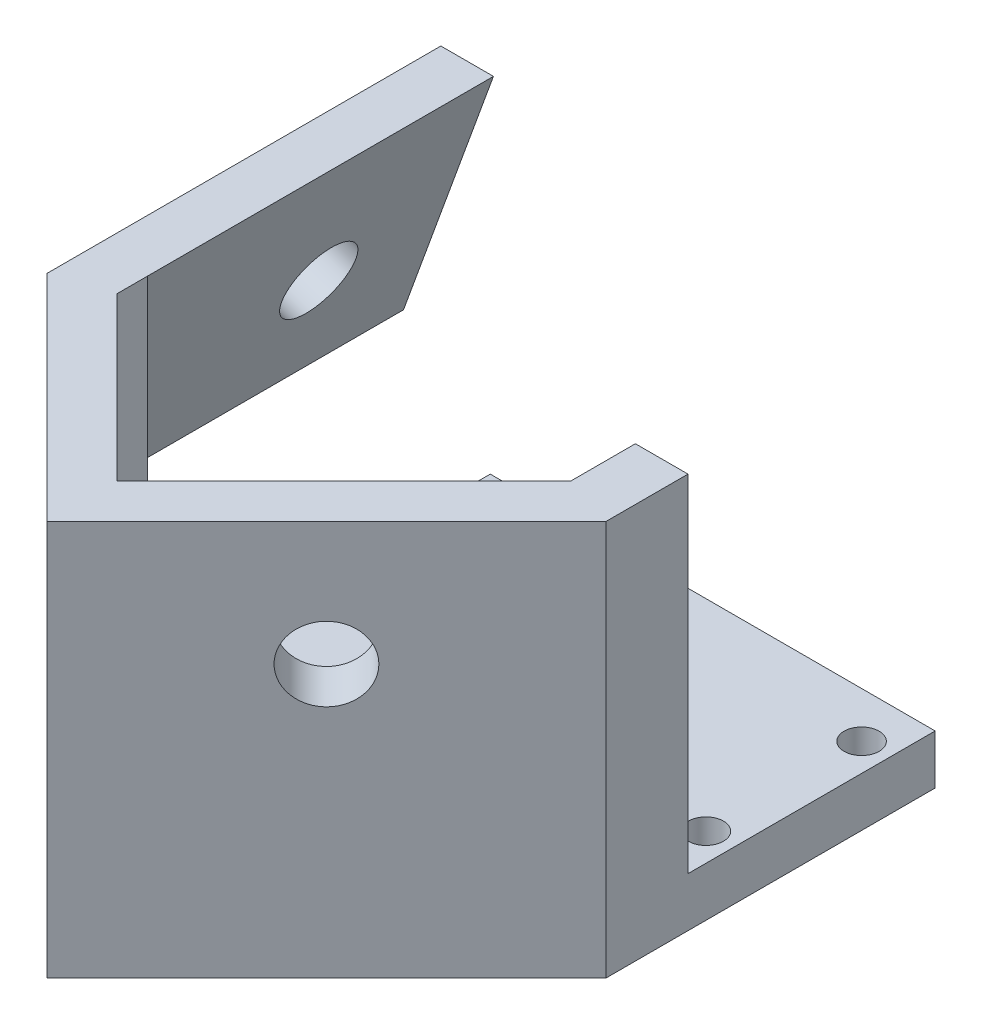
ISO-10303-21;
HEADER;
FILE_DESCRIPTION(('STEP AP214'),'2;1');
FILE_NAME('part.step','',(''),(''),'','','');
FILE_SCHEMA(('AUTOMOTIVE_DESIGN { 1 0 10303 214 1 1 1 1 }'));
ENDSEC;
DATA;
#1=APPLICATION_CONTEXT('core data for automotive mechanical design processes');
#2=APPLICATION_PROTOCOL_DEFINITION('international standard','automotive_design',2000,#1);
#3=PRODUCT_CONTEXT('',#1,'mechanical');
#4=PRODUCT('Part','Part','',(#3));
#5=PRODUCT_RELATED_PRODUCT_CATEGORY('part','',(#4));
#6=PRODUCT_DEFINITION_FORMATION('','',#4);
#7=PRODUCT_DEFINITION_CONTEXT('part definition',#1,'design');
#8=PRODUCT_DEFINITION('design','',#6,#7);
#9=PRODUCT_DEFINITION_SHAPE('','',#8);
#10=(LENGTH_UNIT() NAMED_UNIT(*) SI_UNIT(.MILLI.,.METRE.));
#11=(NAMED_UNIT(*) PLANE_ANGLE_UNIT() SI_UNIT($,.RADIAN.));
#12=(NAMED_UNIT(*) SI_UNIT($,.STERADIAN.) SOLID_ANGLE_UNIT());
#13=UNCERTAINTY_MEASURE_WITH_UNIT(LENGTH_MEASURE(1.E-05),#10,'distance_accuracy_value','');
#14=(GEOMETRIC_REPRESENTATION_CONTEXT(3) GLOBAL_UNCERTAINTY_ASSIGNED_CONTEXT((#13)) GLOBAL_UNIT_ASSIGNED_CONTEXT((#10,
#11,#12)) REPRESENTATION_CONTEXT('',''));
#15=CARTESIAN_POINT('',(0.,0.,0.));
#16=DIRECTION('',(0.,0.,1.));
#17=DIRECTION('',(1.,0.,0.));
#18=AXIS2_PLACEMENT_3D('',#15,#16,#17);
#19=CARTESIAN_POINT('',(-20.8214466605013,-91.040033250916,-10.5210244842766));
#20=DIRECTION('',(-1.,0.,0.));
#21=DIRECTION('',(0.,0.,1.));
#22=AXIS2_PLACEMENT_3D('',#19,#20,#21);
#23=PLANE('',#22);
#24=DIRECTION('',(0.,-1.,0.));
#25=VECTOR('',#24,1.);
#26=CARTESIAN_POINT('',(-20.8214466605013,15.875,2.17897551572339));
#27=LINE('',#26,#25);
#28=CARTESIAN_POINT('',(-20.8214466605013,15.875,2.17897551572339));
#29=VERTEX_POINT('',#28);
#30=CARTESIAN_POINT('',(-20.8214466605013,-28.575,2.17897551572339));
#31=VERTEX_POINT('',#30);
#32=EDGE_CURVE('E170',#29,#31,#27,.T.);
#33=ORIENTED_EDGE('',*,*,#32,.F.);
#34=DIRECTION('',(0.,0.,1.));
#35=VECTOR('',#34,1.);
#36=CARTESIAN_POINT('',(-20.8214466605013,15.875,-10.5210244842766));
#37=LINE('',#36,#35);
#38=CARTESIAN_POINT('',(-20.8214466605013,15.875,6.11932170270612));
#39=VERTEX_POINT('',#38);
#40=EDGE_CURVE('E175',#29,#39,#37,.T.);
#41=ORIENTED_EDGE('',*,*,#40,.T.);
#42=DIRECTION('',(0.,1.,0.));
#43=VECTOR('',#42,1.);
#44=CARTESIAN_POINT('',(-20.8214466605013,-91.040033250916,6.11932170270612));
#45=LINE('',#44,#43);
#46=CARTESIAN_POINT('',(-20.8214466605013,-28.575,6.11932170270612));
#47=VERTEX_POINT('',#46);
#48=EDGE_CURVE('E192',#47,#39,#45,.T.);
#49=ORIENTED_EDGE('',*,*,#48,.F.);
#50=DIRECTION('',(0.,0.,-1.));
#51=VECTOR('',#50,1.);
#52=CARTESIAN_POINT('',(-20.8214466605013,-28.575,-10.5210244842766));
#53=LINE('',#52,#51);
#54=EDGE_CURVE('E182',#47,#31,#53,.T.);
#55=ORIENTED_EDGE('',*,*,#54,.T.);
#56=EDGE_LOOP('',(#33,#41,#49,#55));
#57=FACE_BOUND('',#56,.T.);
#58=ADVANCED_FACE('F35',(#57),#23,.F.);
#59=CARTESIAN_POINT('',(0.,0.,-10.5210244842766));
#60=DIRECTION('',(0.,0.,1.));
#61=DIRECTION('',(1.,0.,0.));
#62=AXIS2_PLACEMENT_3D('',#59,#60,#61);
#63=PLANE('',#62);
#64=DIRECTION('',(1.,0.,0.));
#65=VECTOR('',#64,1.);
#66=CARTESIAN_POINT('',(-32.3775015984534,-28.575,-10.5210244842766));
#67=LINE('',#66,#65);
#68=CARTESIAN_POINT('',(29.1634956290545,-28.575,-10.5210244842766));
#69=VERTEX_POINT('',#68);
#70=CARTESIAN_POINT('',(35.9210244842766,-28.575,-10.5210244842766));
#71=VERTEX_POINT('',#70);
#72=EDGE_CURVE('E253',#69,#71,#67,.T.);
#73=ORIENTED_EDGE('',*,*,#72,.F.);
#74=DIRECTION('',(0.,1.,0.));
#75=VECTOR('',#74,1.);
#76=CARTESIAN_POINT('',(29.1634956290545,-91.040033250916,-10.5210244842766));
#77=LINE('',#76,#75);
#78=CARTESIAN_POINT('',(29.1634956290545,15.875,-10.5210244842766));
#79=VERTEX_POINT('',#78);
#80=EDGE_CURVE('E58',#69,#79,#77,.T.);
#81=ORIENTED_EDGE('',*,*,#80,.T.);
#82=DIRECTION('',(1.,0.,0.));
#83=VECTOR('',#82,1.);
#84=CARTESIAN_POINT('',(35.9210244842766,15.875,-10.5210244842766));
#85=LINE('',#84,#83);
#86=CARTESIAN_POINT('',(35.9210244842766,15.875,-10.5210244842766));
#87=VERTEX_POINT('',#86);
#88=EDGE_CURVE('E262',#79,#87,#85,.T.);
#89=ORIENTED_EDGE('',*,*,#88,.T.);
#90=DIRECTION('',(0.,-1.,0.));
#91=VECTOR('',#90,1.);
#92=CARTESIAN_POINT('',(35.9210244842766,-15.875,-10.5210244842766));
#93=LINE('',#92,#91);
#94=EDGE_CURVE('E259',#87,#71,#93,.T.);
#95=ORIENTED_EDGE('',*,*,#94,.T.);
#96=EDGE_LOOP('',(#73,#81,#89,#95));
#97=FACE_BOUND('',#96,.T.);
#98=ADVANCED_FACE('F325',(#97),#63,.F.);
#99=CARTESIAN_POINT('',(-39.1350304536755,-34.925,-42.2710244842766));
#100=DIRECTION('',(0.,0.,1.));
#101=DIRECTION('',(1.,0.,0.));
#102=AXIS2_PLACEMENT_3D('',#99,#100,#101);
#103=PLANE('',#102);
#104=DIRECTION('',(0.,-1.,0.));
#105=VECTOR('',#104,1.);
#106=CARTESIAN_POINT('',(-21.2289755157234,-28.575,-42.2710244842766));
#107=LINE('',#106,#105);
#108=CARTESIAN_POINT('',(-21.2289755157234,-28.575,-42.2710244842766));
#109=VERTEX_POINT('',#108);
#110=CARTESIAN_POINT('',(-21.2289755157234,-34.925,-42.2710244842766));
#111=VERTEX_POINT('',#110);
#112=EDGE_CURVE('E226',#109,#111,#107,.T.);
#113=ORIENTED_EDGE('',*,*,#112,.F.);
#114=DIRECTION('',(1.,0.,0.));
#115=VECTOR('',#114,1.);
#116=CARTESIAN_POINT('',(-39.1350304536755,-28.575,-42.2710244842766));
#117=LINE('',#116,#115);
#118=CARTESIAN_POINT('',(35.9210244842766,-28.575,-42.2710244842766));
#119=VERTEX_POINT('',#118);
#120=EDGE_CURVE('E239',#109,#119,#117,.T.);
#121=ORIENTED_EDGE('',*,*,#120,.T.);
#122=DIRECTION('',(0.,1.,0.));
#123=VECTOR('',#122,1.);
#124=CARTESIAN_POINT('',(35.9210244842766,-34.925,-42.2710244842766));
#125=LINE('',#124,#123);
#126=CARTESIAN_POINT('',(35.9210244842766,-34.925,-42.2710244842766));
#127=VERTEX_POINT('',#126);
#128=EDGE_CURVE('E247',#127,#119,#125,.T.);
#129=ORIENTED_EDGE('',*,*,#128,.F.);
#130=DIRECTION('',(1.,0.,0.));
#131=VECTOR('',#130,1.);
#132=CARTESIAN_POINT('',(-39.1350304536755,-34.925,-42.2710244842766));
#133=LINE('',#132,#131);
#134=EDGE_CURVE('E245',#111,#127,#133,.T.);
#135=ORIENTED_EDGE('',*,*,#134,.F.);
#136=EDGE_LOOP('',(#113,#121,#129,#135));
#137=FACE_BOUND('',#136,.T.);
#138=ADVANCED_FACE('F331',(#137),#103,.F.);
#139=CARTESIAN_POINT('',(0.,-34.925,0.));
#140=DIRECTION('',(0.,1.,0.));
#141=DIRECTION('',(0.,0.,1.));
#142=AXIS2_PLACEMENT_3D('',#139,#140,#141);
#143=PLANE('',#142);
#144=CARTESIAN_POINT('',(-17.6539755157234,-34.925,-36.3960244842766));
#145=DIRECTION('',(0.,-1.,0.));
#146=DIRECTION('',(0.,0.,-1.));
#147=AXIS2_PLACEMENT_3D('',#144,#145,#146);
#148=CIRCLE('',#147,2.25);
#149=CARTESIAN_POINT('',(-17.6539755157234,-34.925,-38.6460244842766));
#150=VERTEX_POINT('',#149);
#151=EDGE_CURVE('E216',#150,#150,#148,.T.);
#152=ORIENTED_EDGE('',*,*,#151,.F.);
#153=EDGE_LOOP('',(#152));
#154=FACE_BOUND('',#153,.T.);
#155=CARTESIAN_POINT('',(-17.6539755157234,-34.925,-16.3960244842766));
#156=DIRECTION('',(0.,-1.,0.));
#157=DIRECTION('',(0.,0.,-1.));
#158=AXIS2_PLACEMENT_3D('',#155,#156,#157);
#159=CIRCLE('',#158,2.25);
#160=CARTESIAN_POINT('',(-17.6539755157234,-34.925,-18.6460244842766));
#161=VERTEX_POINT('',#160);
#162=EDGE_CURVE('E210',#161,#161,#159,.T.);
#163=ORIENTED_EDGE('',*,*,#162,.F.);
#164=EDGE_LOOP('',(#163));
#165=FACE_BOUND('',#164,.T.);
#166=CARTESIAN_POINT('',(32.3460244842766,-34.925,-16.3960244842766));
#167=DIRECTION('',(0.,-1.,0.));
#168=DIRECTION('',(0.,0.,-1.));
#169=AXIS2_PLACEMENT_3D('',#166,#167,#168);
#170=CIRCLE('',#169,2.25000000000001);
#171=CARTESIAN_POINT('',(32.3460244842766,-34.925,-18.6460244842766));
#172=VERTEX_POINT('',#171);
#173=EDGE_CURVE('E203',#172,#172,#170,.T.);
#174=ORIENTED_EDGE('',*,*,#173,.F.);
#175=EDGE_LOOP('',(#174));
#176=FACE_BOUND('',#175,.T.);
#177=CARTESIAN_POINT('',(32.3460244842766,-34.925,-36.3960244842766));
#178=DIRECTION('',(0.,-1.,0.));
#179=DIRECTION('',(0.,0.,-1.));
#180=AXIS2_PLACEMENT_3D('',#177,#178,#179);
#181=CIRCLE('',#180,2.25000000000002);
#182=CARTESIAN_POINT('',(32.3460244842766,-34.925,-38.6460244842766));
#183=VERTEX_POINT('',#182);
#184=EDGE_CURVE('E223',#183,#183,#181,.T.);
#185=ORIENTED_EDGE('',*,*,#184,.F.);
#186=EDGE_LOOP('',(#185));
#187=FACE_BOUND('',#186,.T.);
#188=DIRECTION('',(-0.707106781186547,0.,-0.707106781186548));
#189=VECTOR('',#188,1.);
#190=CARTESIAN_POINT('',(0.,-34.925,35.9210244842766));
#191=LINE('',#190,#189);
#192=CARTESIAN_POINT('',(0.,-34.925,35.9210244842766));
#193=VERTEX_POINT('',#192);
#194=CARTESIAN_POINT('',(-21.2289755157234,-34.925,14.6920489685532));
#195=VERTEX_POINT('',#194);
#196=EDGE_CURVE('E242',#193,#195,#191,.T.);
#197=ORIENTED_EDGE('',*,*,#196,.T.);
#198=DIRECTION('',(0.,0.,1.));
#199=VECTOR('',#198,1.);
#200=CARTESIAN_POINT('',(-21.2289755157234,-34.925,-42.2710244842766));
#201=LINE('',#200,#199);
#202=EDGE_CURVE('E230',#111,#195,#201,.T.);
#203=ORIENTED_EDGE('',*,*,#202,.F.);
#204=ORIENTED_EDGE('',*,*,#134,.T.);
#205=DIRECTION('',(0.,0.,1.));
#206=VECTOR('',#205,1.);
#207=CARTESIAN_POINT('',(35.9210244842766,-34.925,-42.2710244842766));
#208=LINE('',#207,#206);
#209=CARTESIAN_POINT('',(35.9210244842766,-34.925,0.));
#210=VERTEX_POINT('',#209);
#211=EDGE_CURVE('E235',#127,#210,#208,.T.);
#212=ORIENTED_EDGE('',*,*,#211,.T.);
#213=DIRECTION('',(-0.707106781186548,0.,0.707106781186547));
#214=VECTOR('',#213,1.);
#215=CARTESIAN_POINT('',(35.9210244842766,-34.925,0.));
#216=LINE('',#215,#214);
#217=EDGE_CURVE('E238',#210,#193,#216,.T.);
#218=ORIENTED_EDGE('',*,*,#217,.T.);
#219=EDGE_LOOP('',(#197,#203,#204,#212,#218));
#220=FACE_BOUND('',#219,.T.);
#221=ADVANCED_FACE('F350',(#154,#165,#176,#187,#220),#143,.F.);
#222=CARTESIAN_POINT('',(0.,-28.575,0.));
#223=DIRECTION('',(0.,1.,0.));
#224=DIRECTION('',(0.,0.,1.));
#225=AXIS2_PLACEMENT_3D('',#222,#223,#224);
#226=PLANE('',#225);
#227=CARTESIAN_POINT('',(-17.6539755157234,-28.575,-36.3960244842766));
#228=DIRECTION('',(0.,1.,0.));
#229=DIRECTION('',(0.,0.,1.));
#230=AXIS2_PLACEMENT_3D('',#227,#228,#229);
#231=CIRCLE('',#230,2.25);
#232=CARTESIAN_POINT('',(-17.6539755157234,-28.575,-34.1460244842766));
#233=VERTEX_POINT('',#232);
#234=EDGE_CURVE('E219',#233,#233,#231,.F.);
#235=ORIENTED_EDGE('',*,*,#234,.T.);
#236=EDGE_LOOP('',(#235));
#237=FACE_BOUND('',#236,.T.);
#238=CARTESIAN_POINT('',(-17.6539755157234,-28.575,-16.3960244842766));
#239=DIRECTION('',(0.,1.,0.));
#240=DIRECTION('',(0.,0.,1.));
#241=AXIS2_PLACEMENT_3D('',#238,#239,#240);
#242=CIRCLE('',#241,2.25);
#243=CARTESIAN_POINT('',(-17.6539755157234,-28.575,-14.1460244842766));
#244=VERTEX_POINT('',#243);
#245=EDGE_CURVE('E213',#244,#244,#242,.F.);
#246=ORIENTED_EDGE('',*,*,#245,.T.);
#247=EDGE_LOOP('',(#246));
#248=FACE_BOUND('',#247,.T.);
#249=CARTESIAN_POINT('',(32.3460244842766,-28.575,-16.3960244842766));
#250=DIRECTION('',(0.,1.,0.));
#251=DIRECTION('',(0.,0.,1.));
#252=AXIS2_PLACEMENT_3D('',#249,#250,#251);
#253=CIRCLE('',#252,2.25000000000001);
#254=CARTESIAN_POINT('',(32.3460244842766,-28.575,-14.1460244842766));
#255=VERTEX_POINT('',#254);
#256=EDGE_CURVE('E207',#255,#255,#253,.F.);
#257=ORIENTED_EDGE('',*,*,#256,.T.);
#258=EDGE_LOOP('',(#257));
#259=FACE_BOUND('',#258,.T.);
#260=CARTESIAN_POINT('',(32.3460244842766,-28.575,-36.3960244842766));
#261=DIRECTION('',(0.,1.,0.));
#262=DIRECTION('',(0.,0.,1.));
#263=AXIS2_PLACEMENT_3D('',#260,#261,#262);
#264=CIRCLE('',#263,2.25000000000002);
#265=CARTESIAN_POINT('',(32.3460244842766,-28.575,-34.1460244842766));
#266=VERTEX_POINT('',#265);
#267=EDGE_CURVE('E206',#266,#266,#264,.F.);
#268=ORIENTED_EDGE('',*,*,#267,.T.);
#269=EDGE_LOOP('',(#268));
#270=FACE_BOUND('',#269,.T.);
#271=ORIENTED_EDGE('',*,*,#120,.F.);
#272=DIRECTION('',(0.,0.,1.));
#273=VECTOR('',#272,1.);
#274=CARTESIAN_POINT('',(-21.2289755157234,-28.575,-42.2710244842766));
#275=LINE('',#274,#273);
#276=CARTESIAN_POINT('',(-21.2289755157234,-28.575,2.17897551572339));
#277=VERTEX_POINT('',#276);
#278=EDGE_CURVE('E232',#109,#277,#275,.T.);
#279=ORIENTED_EDGE('',*,*,#278,.T.);
#280=DIRECTION('',(-1.,0.,0.));
#281=VECTOR('',#280,1.);
#282=CARTESIAN_POINT('',(-20.8214466605013,-28.575,2.17897551572339));
#283=LINE('',#282,#281);
#284=EDGE_CURVE('E164',#31,#277,#283,.T.);
#285=ORIENTED_EDGE('',*,*,#284,.F.);
#286=ORIENTED_EDGE('',*,*,#54,.F.);
#287=DIRECTION('',(-0.707106781186548,0.,-0.707106781186548));
#288=VECTOR('',#287,1.);
#289=CARTESIAN_POINT('',(-20.8214466605013,-28.575,6.11932170270612));
#290=LINE('',#289,#288);
#291=CARTESIAN_POINT('',(0.,-28.575,26.9407683632075));
#292=VERTEX_POINT('',#291);
#293=EDGE_CURVE('E176',#292,#47,#290,.T.);
#294=ORIENTED_EDGE('',*,*,#293,.F.);
#295=DIRECTION('',(-0.707106781186548,0.,0.707106781186548));
#296=VECTOR('',#295,1.);
#297=CARTESIAN_POINT('',(0.,-28.575,26.9407683632075));
#298=LINE('',#297,#296);
#299=CARTESIAN_POINT('',(29.1634956290545,-28.575,-2.22272726584707));
#300=VERTEX_POINT('',#299);
#301=EDGE_CURVE('E178',#300,#292,#298,.T.);
#302=ORIENTED_EDGE('',*,*,#301,.F.);
#303=DIRECTION('',(0.,0.,1.));
#304=VECTOR('',#303,1.);
#305=CARTESIAN_POINT('',(29.1634956290545,-28.575,-2.22272726584707));
#306=LINE('',#305,#304);
#307=EDGE_CURVE('E180',#69,#300,#306,.T.);
#308=ORIENTED_EDGE('',*,*,#307,.F.);
#309=ORIENTED_EDGE('',*,*,#72,.T.);
#310=DIRECTION('',(0.,0.,1.));
#311=VECTOR('',#310,1.);
#312=CARTESIAN_POINT('',(35.9210244842766,-28.575,-10.5210244842766));
#313=LINE('',#312,#311);
#314=EDGE_CURVE('E234',#119,#71,#313,.T.);
#315=ORIENTED_EDGE('',*,*,#314,.F.);
#316=EDGE_LOOP('',(#271,#279,#285,#286,#294,#302,#308,#309,#315));
#317=FACE_BOUND('',#316,.T.);
#318=ADVANCED_FACE('F353',(#237,#248,#259,#270,#317),#226,.T.);
#319=CARTESIAN_POINT('',(0.,-15.875,0.));
#320=DIRECTION('',(0.,1.,0.));
#321=DIRECTION('',(0.,0.,1.));
#322=AXIS2_PLACEMENT_3D('',#319,#320,#321);
#323=PLANE('',#322);
#324=DIRECTION('',(0.,0.,-1.));
#325=VECTOR('',#324,1.);
#326=CARTESIAN_POINT('',(-32.3775015984534,-15.875,-10.5210244842766));
#327=LINE('',#326,#325);
#328=CARTESIAN_POINT('',(-32.3775015984534,-15.875,2.17897551572339));
#329=VERTEX_POINT('',#328);
#330=CARTESIAN_POINT('',(-32.3775015984534,-15.875,-42.2710244842766));
#331=VERTEX_POINT('',#330);
#332=EDGE_CURVE('E159',#329,#331,#327,.T.);
#333=ORIENTED_EDGE('',*,*,#332,.F.);
#334=DIRECTION('',(1.,0.,0.));
#335=VECTOR('',#334,1.);
#336=CARTESIAN_POINT('',(0.,-15.875,2.17897551572338));
#337=LINE('',#336,#335);
#338=CARTESIAN_POINT('',(-21.2289755157234,-15.875,2.17897551572339));
#339=VERTEX_POINT('',#338);
#340=EDGE_CURVE('E11',#329,#339,#337,.T.);
#341=ORIENTED_EDGE('',*,*,#340,.T.);
#342=DIRECTION('',(0.,0.,-1.));
#343=VECTOR('',#342,1.);
#344=CARTESIAN_POINT('',(-21.2289755157234,-15.875,35.9210244842766));
#345=LINE('',#344,#343);
#346=CARTESIAN_POINT('',(-21.2289755157234,-15.875,14.6920489685532));
#347=VERTEX_POINT('',#346);
#348=EDGE_CURVE('E146',#347,#339,#345,.T.);
#349=ORIENTED_EDGE('',*,*,#348,.F.);
#350=DIRECTION('',(0.707106781186547,0.,0.707106781186548));
#351=VECTOR('',#350,1.);
#352=CARTESIAN_POINT('',(-35.9210244842766,-15.875,0.));
#353=LINE('',#352,#351);
#354=CARTESIAN_POINT('',(-39.1350304536755,-15.875,-3.21400596939889));
#355=VERTEX_POINT('',#354);
#356=EDGE_CURVE('E173',#355,#347,#353,.T.);
#357=ORIENTED_EDGE('',*,*,#356,.F.);
#358=DIRECTION('',(0.,0.,1.));
#359=VECTOR('',#358,1.);
#360=CARTESIAN_POINT('',(-39.1350304536755,-15.875,-42.2710244842766));
#361=LINE('',#360,#359);
#362=CARTESIAN_POINT('',(-39.1350304536755,-15.875,-42.2710244842766));
#363=VERTEX_POINT('',#362);
#364=EDGE_CURVE('E280',#363,#355,#361,.T.);
#365=ORIENTED_EDGE('',*,*,#364,.F.);
#366=DIRECTION('',(-1.,0.,0.));
#367=VECTOR('',#366,1.);
#368=CARTESIAN_POINT('',(35.9210244842766,-15.875,-42.2710244842766));
#369=LINE('',#368,#367);
#370=EDGE_CURVE('E274',#331,#363,#369,.T.);
#371=ORIENTED_EDGE('',*,*,#370,.F.);
#372=EDGE_LOOP('',(#333,#341,#349,#357,#365,#371));
#373=FACE_BOUND('',#372,.T.);
#374=ADVANCED_FACE('F157',(#373),#323,.F.);
#375=CARTESIAN_POINT('',(-35.9210244842766,15.875,0.));
#376=DIRECTION('',(0.707106781186548,0.,-0.707106781186547));
#377=DIRECTION('',(-0.707106781186547,0.,-0.707106781186548));
#378=AXIS2_PLACEMENT_3D('',#375,#376,#377);
#379=PLANE('',#378);
#380=CARTESIAN_POINT('',(-17.9605122421383,0.,17.9605122421383));
#381=DIRECTION('',(-0.707106781186548,0.,0.707106781186547));
#382=DIRECTION('',(0.707106781186547,0.,0.707106781186548));
#383=AXIS2_PLACEMENT_3D('',#380,#381,#382);
#384=CIRCLE('',#383,4.7625);
#385=CARTESIAN_POINT('',(-14.5929161967374,0.,21.3281082875392));
#386=VERTEX_POINT('',#385);
#387=EDGE_CURVE('E284',#386,#386,#384,.T.);
#388=ORIENTED_EDGE('',*,*,#387,.F.);
#389=EDGE_LOOP('',(#388));
#390=FACE_BOUND('',#389,.T.);
#391=ORIENTED_EDGE('',*,*,#356,.T.);
#392=DIRECTION('',(0.,-1.,0.));
#393=VECTOR('',#392,1.);
#394=CARTESIAN_POINT('',(-21.2289755157234,15.875,14.6920489685532));
#395=LINE('',#394,#393);
#396=EDGE_CURVE('E152',#347,#195,#395,.T.);
#397=ORIENTED_EDGE('',*,*,#396,.T.);
#398=ORIENTED_EDGE('',*,*,#196,.F.);
#399=DIRECTION('',(0.,-1.,0.));
#400=VECTOR('',#399,1.);
#401=CARTESIAN_POINT('',(0.,15.875,35.9210244842766));
#402=LINE('',#401,#400);
#403=CARTESIAN_POINT('',(0.,15.875,35.9210244842766));
#404=VERTEX_POINT('',#403);
#405=EDGE_CURVE('E43',#404,#193,#402,.T.);
#406=ORIENTED_EDGE('',*,*,#405,.F.);
#407=DIRECTION('',(0.707106781186547,0.,0.707106781186548));
#408=VECTOR('',#407,1.);
#409=CARTESIAN_POINT('',(-35.9210244842766,15.875,0.));
#410=LINE('',#409,#408);
#411=CARTESIAN_POINT('',(-27.5789755157234,15.875,8.34204896855321));
#412=VERTEX_POINT('',#411);
#413=EDGE_CURVE('E290',#412,#404,#410,.T.);
#414=ORIENTED_EDGE('',*,*,#413,.F.);
#415=DIRECTION('',(0.323615577118188,0.889126490715986,0.323615577118189));
#416=VECTOR('',#415,1.);
#417=CARTESIAN_POINT('',(-29.3262517370029,11.0743980364847,6.59477274727374));
#418=LINE('',#417,#416);
#419=EDGE_CURVE('E255',#355,#412,#418,.T.);
#420=ORIENTED_EDGE('',*,*,#419,.F.);
#421=EDGE_LOOP('',(#391,#397,#398,#406,#414,#420));
#422=FACE_BOUND('',#421,.T.);
#423=ADVANCED_FACE('F37',(#390,#422),#379,.F.);
#424=CARTESIAN_POINT('',(0.,15.875,0.));
#425=DIRECTION('',(0.,1.,0.));
#426=DIRECTION('',(0.,0.,1.));
#427=AXIS2_PLACEMENT_3D('',#424,#425,#426);
#428=PLANE('',#427);
#429=DIRECTION('',(0.,0.,-1.));
#430=VECTOR('',#429,1.);
#431=CARTESIAN_POINT('',(29.1634956290545,15.875,-2.22272726584707));
#432=LINE('',#431,#430);
#433=CARTESIAN_POINT('',(29.1634956290545,15.875,-2.22272726584707));
#434=VERTEX_POINT('',#433);
#435=EDGE_CURVE('E190',#434,#79,#432,.T.);
#436=ORIENTED_EDGE('',*,*,#435,.F.);
#437=DIRECTION('',(0.707106781186547,0.,-0.707106781186547));
#438=VECTOR('',#437,1.);
#439=CARTESIAN_POINT('',(0.,15.875,26.9407683632075));
#440=LINE('',#439,#438);
#441=CARTESIAN_POINT('',(0.,15.875,26.9407683632075));
#442=VERTEX_POINT('',#441);
#443=EDGE_CURVE('E187',#442,#434,#440,.T.);
#444=ORIENTED_EDGE('',*,*,#443,.F.);
#445=DIRECTION('',(0.707106781186548,0.,0.707106781186548));
#446=VECTOR('',#445,1.);
#447=CARTESIAN_POINT('',(-20.8214466605013,15.875,6.11932170270612));
#448=LINE('',#447,#446);
#449=EDGE_CURVE('E184',#39,#442,#448,.T.);
#450=ORIENTED_EDGE('',*,*,#449,.F.);
#451=ORIENTED_EDGE('',*,*,#40,.F.);
#452=DIRECTION('',(0.,0.,-1.));
#453=VECTOR('',#452,1.);
#454=CARTESIAN_POINT('',(-20.8214466605013,15.875,-10.5210244842766));
#455=LINE('',#454,#453);
#456=CARTESIAN_POINT('',(-20.8214466605014,15.875,-42.2710244842766));
#457=VERTEX_POINT('',#456);
#458=EDGE_CURVE('E50',#29,#457,#455,.T.);
#459=ORIENTED_EDGE('',*,*,#458,.T.);
#460=DIRECTION('',(1.,0.,0.));
#461=VECTOR('',#460,1.);
#462=CARTESIAN_POINT('',(-27.5789755157234,15.875,-42.2710244842766));
#463=LINE('',#462,#461);
#464=CARTESIAN_POINT('',(-27.5789755157234,15.875,-42.2710244842766));
#465=VERTEX_POINT('',#464);
#466=EDGE_CURVE('E271',#465,#457,#463,.T.);
#467=ORIENTED_EDGE('',*,*,#466,.F.);
#468=DIRECTION('',(0.,0.,1.));
#469=VECTOR('',#468,1.);
#470=CARTESIAN_POINT('',(-27.5789755157234,15.875,-42.2710244842766));
#471=LINE('',#470,#469);
#472=EDGE_CURVE('E278',#465,#412,#471,.T.);
#473=ORIENTED_EDGE('',*,*,#472,.T.);
#474=ORIENTED_EDGE('',*,*,#413,.T.);
#475=DIRECTION('',(0.707106781186548,0.,-0.707106781186547));
#476=VECTOR('',#475,1.);
#477=CARTESIAN_POINT('',(0.,15.875,35.9210244842766));
#478=LINE('',#477,#476);
#479=CARTESIAN_POINT('',(35.9210244842766,15.875,0.));
#480=VERTEX_POINT('',#479);
#481=EDGE_CURVE('E292',#404,#480,#478,.T.);
#482=ORIENTED_EDGE('',*,*,#481,.T.);
#483=DIRECTION('',(0.,0.,1.));
#484=VECTOR('',#483,1.);
#485=CARTESIAN_POINT('',(35.9210244842766,15.875,-42.2710244842766));
#486=LINE('',#485,#484);
#487=EDGE_CURVE('E282',#87,#480,#486,.T.);
#488=ORIENTED_EDGE('',*,*,#487,.F.);
#489=ORIENTED_EDGE('',*,*,#88,.F.);
#490=EDGE_LOOP('',(#436,#444,#450,#451,#459,#467,#473,#474,#482,#488,#489));
#491=FACE_BOUND('',#490,.T.);
#492=ADVANCED_FACE('F386',(#491),#428,.T.);
#493=CARTESIAN_POINT('',(0.,15.875,35.9210244842766));
#494=DIRECTION('',(-0.707106781186547,0.,-0.707106781186548));
#495=DIRECTION('',(-0.707106781186548,0.,0.707106781186547));
#496=AXIS2_PLACEMENT_3D('',#493,#494,#495);
#497=PLANE('',#496);
#498=CARTESIAN_POINT('',(17.9605122421383,0.,17.9605122421383));
#499=DIRECTION('',(0.707106781186548,0.,0.707106781186548));
#500=DIRECTION('',(0.707106781186548,0.,-0.707106781186548));
#501=AXIS2_PLACEMENT_3D('',#498,#499,#500);
#502=CIRCLE('',#501,4.7625);
#503=CARTESIAN_POINT('',(21.3281082875392,0.,14.5929161967374));
#504=VERTEX_POINT('',#503);
#505=EDGE_CURVE('E287',#504,#504,#502,.T.);
#506=ORIENTED_EDGE('',*,*,#505,.F.);
#507=EDGE_LOOP('',(#506));
#508=FACE_BOUND('',#507,.T.);
#509=ORIENTED_EDGE('',*,*,#405,.T.);
#510=ORIENTED_EDGE('',*,*,#217,.F.);
#511=DIRECTION('',(0.,-1.,0.));
#512=VECTOR('',#511,1.);
#513=CARTESIAN_POINT('',(35.9210244842766,15.875,0.));
#514=LINE('',#513,#512);
#515=EDGE_CURVE('E295',#480,#210,#514,.T.);
#516=ORIENTED_EDGE('',*,*,#515,.F.);
#517=ORIENTED_EDGE('',*,*,#481,.F.);
#518=EDGE_LOOP('',(#509,#510,#516,#517));
#519=FACE_BOUND('',#518,.T.);
#520=ADVANCED_FACE('F385',(#508,#519),#497,.F.);
#521=CARTESIAN_POINT('',(12.3036579926459,0.,12.3036579926459));
#522=DIRECTION('',(0.707106781186547,0.,0.707106781186547));
#523=DIRECTION('',(0.707106781186548,0.,-0.707106781186548));
#524=AXIS2_PLACEMENT_3D('',#521,#522,#523);
#525=CYLINDRICAL_SURFACE('',#524,4.7625);
#526=CARTESIAN_POINT('',(13.4703841816037,0.,13.4703841816037));
#527=DIRECTION('',(0.707106781186547,0.,0.707106781186547));
#528=DIRECTION('',(0.707106781186548,0.,-0.707106781186548));
#529=AXIS2_PLACEMENT_3D('',#526,#527,#528);
#530=CIRCLE('',#529,4.7625);
#531=CARTESIAN_POINT('',(16.8379802270047,0.,10.1027881362028));
#532=VERTEX_POINT('',#531);
#533=EDGE_CURVE('E222',#532,#532,#530,.F.);
#534=ORIENTED_EDGE('',*,*,#533,.T.);
#535=EDGE_LOOP('',(#534));
#536=FACE_BOUND('',#535,.T.);
#537=ORIENTED_EDGE('',*,*,#505,.T.);
#538=EDGE_LOOP('',(#537));
#539=FACE_BOUND('',#538,.T.);
#540=ADVANCED_FACE('F304',(#536,#539),#525,.F.);
#541=CARTESIAN_POINT('',(-12.3036579926459,0.,12.3036579926459));
#542=DIRECTION('',(-0.707106781186548,0.,0.707106781186547));
#543=DIRECTION('',(0.707106781186547,0.,0.707106781186548));
#544=AXIS2_PLACEMENT_3D('',#541,#542,#543);
#545=CYLINDRICAL_SURFACE('',#544,4.7625);
#546=CARTESIAN_POINT('',(-13.4703841816037,0.,13.4703841816037));
#547=DIRECTION('',(-0.707106781186548,0.,0.707106781186548));
#548=DIRECTION('',(0.707106781186548,0.,0.707106781186548));
#549=AXIS2_PLACEMENT_3D('',#546,#547,#548);
#550=CIRCLE('',#549,4.7625);
#551=CARTESIAN_POINT('',(-10.1027881362028,0.,16.8379802270047));
#552=VERTEX_POINT('',#551);
#553=EDGE_CURVE('E202',#552,#552,#550,.F.);
#554=ORIENTED_EDGE('',*,*,#553,.T.);
#555=EDGE_LOOP('',(#554));
#556=FACE_BOUND('',#555,.T.);
#557=ORIENTED_EDGE('',*,*,#387,.T.);
#558=EDGE_LOOP('',(#557));
#559=FACE_BOUND('',#558,.T.);
#560=ADVANCED_FACE('F378',(#556,#559),#545,.F.);
#561=CARTESIAN_POINT('',(35.9210244842766,15.875,-42.2710244842766));
#562=DIRECTION('',(-1.,0.,0.));
#563=DIRECTION('',(0.,-1.,0.));
#564=AXIS2_PLACEMENT_3D('',#561,#562,#563);
#565=PLANE('',#564);
#566=ORIENTED_EDGE('',*,*,#515,.T.);
#567=ORIENTED_EDGE('',*,*,#211,.F.);
#568=ORIENTED_EDGE('',*,*,#128,.T.);
#569=ORIENTED_EDGE('',*,*,#314,.T.);
#570=ORIENTED_EDGE('',*,*,#94,.F.);
#571=ORIENTED_EDGE('',*,*,#487,.T.);
#572=EDGE_LOOP('',(#566,#567,#568,#569,#570,#571));
#573=FACE_BOUND('',#572,.T.);
#574=ADVANCED_FACE('F374',(#573),#565,.F.);
#575=CARTESIAN_POINT('',(-39.1350304536755,-15.875,-42.2710244842766));
#576=DIRECTION('',(0.939692620785907,-0.342020143325673,0.));
#577=DIRECTION('',(0.342020143325673,0.939692620785907,0.));
#578=AXIS2_PLACEMENT_3D('',#575,#576,#577);
#579=PLANE('',#578);
#580=CARTESIAN_POINT('',(-33.3570029846995,0.,-26.3960244842766));
#581=DIRECTION('',(-0.939692620785907,0.342020143325672,0.));
#582=DIRECTION('',(-0.342020143325672,-0.939692620785907,0.));
#583=AXIS2_PLACEMENT_3D('',#580,#581,#582);
#584=CIRCLE('',#583,4.7625);
#585=CARTESIAN_POINT('',(-34.985873917288,-4.47528610649289,-26.3960244842766));
#586=VERTEX_POINT('',#585);
#587=EDGE_CURVE('E268',#586,#586,#584,.T.);
#588=ORIENTED_EDGE('',*,*,#587,.F.);
#589=EDGE_LOOP('',(#588));
#590=FACE_BOUND('',#589,.T.);
#591=ORIENTED_EDGE('',*,*,#364,.T.);
#592=ORIENTED_EDGE('',*,*,#419,.T.);
#593=ORIENTED_EDGE('',*,*,#472,.F.);
#594=DIRECTION('',(0.342020143325673,0.939692620785907,0.));
#595=VECTOR('',#594,1.);
#596=CARTESIAN_POINT('',(-39.1350304536755,-15.875,-42.2710244842766));
#597=LINE('',#596,#595);
#598=EDGE_CURVE('E276',#363,#465,#597,.T.);
#599=ORIENTED_EDGE('',*,*,#598,.F.);
#600=EDGE_LOOP('',(#591,#592,#593,#599));
#601=FACE_BOUND('',#600,.T.);
#602=ADVANCED_FACE('F370',(#590,#601),#579,.F.);
#603=CARTESIAN_POINT('',(0.,0.,-42.2710244842766));
#604=DIRECTION('',(0.,0.,-1.));
#605=DIRECTION('',(-1.,0.,0.));
#606=AXIS2_PLACEMENT_3D('',#603,#604,#605);
#607=PLANE('',#606);
#608=DIRECTION('',(0.342020143325673,0.939692620785907,0.));
#609=VECTOR('',#608,1.);
#610=CARTESIAN_POINT('',(-20.8214466605014,15.875,-42.2710244842766));
#611=LINE('',#610,#609);
#612=EDGE_CURVE('E258',#331,#457,#611,.T.);
#613=ORIENTED_EDGE('',*,*,#612,.F.);
#614=ORIENTED_EDGE('',*,*,#370,.T.);
#615=ORIENTED_EDGE('',*,*,#598,.T.);
#616=ORIENTED_EDGE('',*,*,#466,.T.);
#617=EDGE_LOOP('',(#613,#614,#615,#616));
#618=FACE_BOUND('',#617,.T.);
#619=ADVANCED_FACE('F366',(#618),#607,.T.);
#620=CARTESIAN_POINT('',(32.9191613881019,-24.1225510730341,-26.3960244842766));
#621=DIRECTION('',(-0.939692620785907,0.342020143325672,0.));
#622=DIRECTION('',(-0.342020143325672,-0.939692620785907,0.));
#623=AXIS2_PLACEMENT_3D('',#620,#621,#622);
#624=CYLINDRICAL_SURFACE('',#623,4.7625);
#625=CARTESIAN_POINT('',(-27.3899548427089,-2.17182791011803,-26.3960244842766));
#626=DIRECTION('',(-0.939692620785907,0.342020143325673,0.));
#627=DIRECTION('',(-0.342020143325673,-0.939692620785907,0.));
#628=AXIS2_PLACEMENT_3D('',#625,#626,#627);
#629=CIRCLE('',#628,4.7625);
#630=CARTESIAN_POINT('',(-29.0188257752975,-6.64711401661091,-26.3960244842766));
#631=VERTEX_POINT('',#630);
#632=EDGE_CURVE('E266',#631,#631,#629,.F.);
#633=ORIENTED_EDGE('',*,*,#632,.T.);
#634=EDGE_LOOP('',(#633));
#635=FACE_BOUND('',#634,.T.);
#636=ORIENTED_EDGE('',*,*,#587,.T.);
#637=EDGE_LOOP('',(#636));
#638=FACE_BOUND('',#637,.T.);
#639=ADVANCED_FACE('F363',(#635,#638),#624,.F.);
#640=CARTESIAN_POINT('',(-20.8214466605013,15.875,-10.5210244842766));
#641=DIRECTION('',(-0.939692620785907,0.342020143325673,0.));
#642=DIRECTION('',(-0.342020143325673,-0.939692620785907,0.));
#643=AXIS2_PLACEMENT_3D('',#640,#641,#642);
#644=PLANE('',#643);
#645=ORIENTED_EDGE('',*,*,#612,.T.);
#646=ORIENTED_EDGE('',*,*,#458,.F.);
#647=DIRECTION('',(0.342020143325673,0.939692620785907,0.));
#648=VECTOR('',#647,1.);
#649=CARTESIAN_POINT('',(-32.3775015984534,-15.875,2.17897551572339));
#650=LINE('',#649,#648);
#651=EDGE_CURVE('E168',#329,#29,#650,.T.);
#652=ORIENTED_EDGE('',*,*,#651,.F.);
#653=ORIENTED_EDGE('',*,*,#332,.T.);
#654=EDGE_LOOP('',(#645,#646,#652,#653));
#655=FACE_BOUND('',#654,.T.);
#656=ORIENTED_EDGE('',*,*,#632,.F.);
#657=EDGE_LOOP('',(#656));
#658=FACE_BOUND('',#657,.T.);
#659=ADVANCED_FACE('F349',(#655,#658),#644,.F.);
#660=CARTESIAN_POINT('',(-21.2289755157234,-28.575,-42.2710244842766));
#661=DIRECTION('',(-1.,0.,0.));
#662=DIRECTION('',(0.,0.,1.));
#663=AXIS2_PLACEMENT_3D('',#660,#661,#662);
#664=PLANE('',#663);
#665=ORIENTED_EDGE('',*,*,#202,.T.);
#666=ORIENTED_EDGE('',*,*,#396,.F.);
#667=ORIENTED_EDGE('',*,*,#348,.T.);
#668=DIRECTION('',(0.,-1.,0.));
#669=VECTOR('',#668,1.);
#670=CARTESIAN_POINT('',(-21.2289755157234,-34.925,2.17897551572339));
#671=LINE('',#670,#669);
#672=EDGE_CURVE('E149',#339,#277,#671,.T.);
#673=ORIENTED_EDGE('',*,*,#672,.T.);
#674=ORIENTED_EDGE('',*,*,#278,.F.);
#675=ORIENTED_EDGE('',*,*,#112,.T.);
#676=EDGE_LOOP('',(#665,#666,#667,#673,#674,#675));
#677=FACE_BOUND('',#676,.T.);
#678=ADVANCED_FACE('F147',(#677),#664,.T.);
#679=CARTESIAN_POINT('',(32.3460244842766,15.876,-36.3960244842766));
#680=DIRECTION('',(0.,-1.,0.));
#681=DIRECTION('',(0.,0.,-1.));
#682=AXIS2_PLACEMENT_3D('',#679,#680,#681);
#683=CYLINDRICAL_SURFACE('',#682,2.25000000000002);
#684=ORIENTED_EDGE('',*,*,#267,.F.);
#685=EDGE_LOOP('',(#684));
#686=FACE_BOUND('',#685,.T.);
#687=ORIENTED_EDGE('',*,*,#184,.T.);
#688=EDGE_LOOP('',(#687));
#689=FACE_BOUND('',#688,.T.);
#690=ADVANCED_FACE('F339',(#686,#689),#683,.F.);
#691=CARTESIAN_POINT('',(32.3460244842766,15.876,-16.3960244842766));
#692=DIRECTION('',(0.,-1.,0.));
#693=DIRECTION('',(0.,0.,-1.));
#694=AXIS2_PLACEMENT_3D('',#691,#692,#693);
#695=CYLINDRICAL_SURFACE('',#694,2.25000000000001);
#696=ORIENTED_EDGE('',*,*,#256,.F.);
#697=EDGE_LOOP('',(#696));
#698=FACE_BOUND('',#697,.T.);
#699=ORIENTED_EDGE('',*,*,#173,.T.);
#700=EDGE_LOOP('',(#699));
#701=FACE_BOUND('',#700,.T.);
#702=ADVANCED_FACE('F336',(#698,#701),#695,.F.);
#703=CARTESIAN_POINT('',(-17.6539755157234,15.876,-16.3960244842766));
#704=DIRECTION('',(0.,-1.,0.));
#705=DIRECTION('',(0.,0.,-1.));
#706=AXIS2_PLACEMENT_3D('',#703,#704,#705);
#707=CYLINDRICAL_SURFACE('',#706,2.25);
#708=ORIENTED_EDGE('',*,*,#245,.F.);
#709=EDGE_LOOP('',(#708));
#710=FACE_BOUND('',#709,.T.);
#711=ORIENTED_EDGE('',*,*,#162,.T.);
#712=EDGE_LOOP('',(#711));
#713=FACE_BOUND('',#712,.T.);
#714=ADVANCED_FACE('F320',(#710,#713),#707,.F.);
#715=CARTESIAN_POINT('',(-17.6539755157234,15.876,-36.3960244842766));
#716=DIRECTION('',(0.,-1.,0.));
#717=DIRECTION('',(0.,0.,-1.));
#718=AXIS2_PLACEMENT_3D('',#715,#716,#717);
#719=CYLINDRICAL_SURFACE('',#718,2.25);
#720=ORIENTED_EDGE('',*,*,#234,.F.);
#721=EDGE_LOOP('',(#720));
#722=FACE_BOUND('',#721,.T.);
#723=ORIENTED_EDGE('',*,*,#151,.T.);
#724=EDGE_LOOP('',(#723));
#725=FACE_BOUND('',#724,.T.);
#726=ADVANCED_FACE('F310',(#722,#725),#719,.F.);
#727=CARTESIAN_POINT('',(0.,-91.040033250916,26.9407683632075));
#728=DIRECTION('',(0.707106781186547,0.,0.707106781186547));
#729=DIRECTION('',(0.707106781186548,0.,-0.707106781186548));
#730=AXIS2_PLACEMENT_3D('',#727,#728,#729);
#731=PLANE('',#730);
#732=ORIENTED_EDGE('',*,*,#301,.T.);
#733=DIRECTION('',(0.,1.,0.));
#734=VECTOR('',#733,1.);
#735=CARTESIAN_POINT('',(0.,-91.040033250916,26.9407683632075));
#736=LINE('',#735,#734);
#737=EDGE_CURVE('E196',#292,#442,#736,.T.);
#738=ORIENTED_EDGE('',*,*,#737,.T.);
#739=ORIENTED_EDGE('',*,*,#443,.T.);
#740=DIRECTION('',(0.,1.,0.));
#741=VECTOR('',#740,1.);
#742=CARTESIAN_POINT('',(29.1634956290545,-91.040033250916,-2.22272726584707));
#743=LINE('',#742,#741);
#744=EDGE_CURVE('E194',#300,#434,#743,.T.);
#745=ORIENTED_EDGE('',*,*,#744,.F.);
#746=EDGE_LOOP('',(#732,#738,#739,#745));
#747=FACE_BOUND('',#746,.T.);
#748=ORIENTED_EDGE('',*,*,#533,.F.);
#749=EDGE_LOOP('',(#748));
#750=FACE_BOUND('',#749,.T.);
#751=ADVANCED_FACE('F307',(#747,#750),#731,.F.);
#752=CARTESIAN_POINT('',(-20.8214466605013,-91.040033250916,6.11932170270612));
#753=DIRECTION('',(-0.707106781186548,0.,0.707106781186548));
#754=DIRECTION('',(0.707106781186548,0.,0.707106781186548));
#755=AXIS2_PLACEMENT_3D('',#752,#753,#754);
#756=PLANE('',#755);
#757=ORIENTED_EDGE('',*,*,#293,.T.);
#758=ORIENTED_EDGE('',*,*,#48,.T.);
#759=ORIENTED_EDGE('',*,*,#449,.T.);
#760=ORIENTED_EDGE('',*,*,#737,.F.);
#761=EDGE_LOOP('',(#757,#758,#759,#760));
#762=FACE_BOUND('',#761,.T.);
#763=ORIENTED_EDGE('',*,*,#553,.F.);
#764=EDGE_LOOP('',(#763));
#765=FACE_BOUND('',#764,.T.);
#766=ADVANCED_FACE('F309',(#762,#765),#756,.F.);
#767=CARTESIAN_POINT('',(29.1634956290545,-91.040033250916,-2.22272726584707));
#768=DIRECTION('',(1.,0.,0.));
#769=DIRECTION('',(0.,0.,-1.));
#770=AXIS2_PLACEMENT_3D('',#767,#768,#769);
#771=PLANE('',#770);
#772=ORIENTED_EDGE('',*,*,#307,.T.);
#773=ORIENTED_EDGE('',*,*,#744,.T.);
#774=ORIENTED_EDGE('',*,*,#435,.T.);
#775=ORIENTED_EDGE('',*,*,#80,.F.);
#776=EDGE_LOOP('',(#772,#773,#774,#775));
#777=FACE_BOUND('',#776,.T.);
#778=ADVANCED_FACE('F317',(#777),#771,.F.);
#779=CARTESIAN_POINT('',(0.,0.,2.17897551572338));
#780=DIRECTION('',(0.,0.,-1.));
#781=DIRECTION('',(-1.,0.,0.));
#782=AXIS2_PLACEMENT_3D('',#779,#780,#781);
#783=PLANE('',#782);
#784=ORIENTED_EDGE('',*,*,#672,.F.);
#785=ORIENTED_EDGE('',*,*,#340,.F.);
#786=ORIENTED_EDGE('',*,*,#651,.T.);
#787=ORIENTED_EDGE('',*,*,#32,.T.);
#788=ORIENTED_EDGE('',*,*,#284,.T.);
#789=EDGE_LOOP('',(#784,#785,#786,#787,#788));
#790=FACE_BOUND('',#789,.T.);
#791=ADVANCED_FACE('F162',(#790),#783,.T.);
#792=CLOSED_SHELL('',(#58,#98,#138,#221,#318,#374,#423,#492,#520,#540,#560,#574,#602,#619,#639,
#659,#678,#690,#702,#714,#726,#751,#766,#778,#791));
#793=MANIFOLD_SOLID_BREP('B2',#792);
#794=ADVANCED_BREP_SHAPE_REPRESENTATION('',(#18,#793),#14);
#795=SHAPE_DEFINITION_REPRESENTATION(#9,#794);
ENDSEC;
END-ISO-10303-21;
